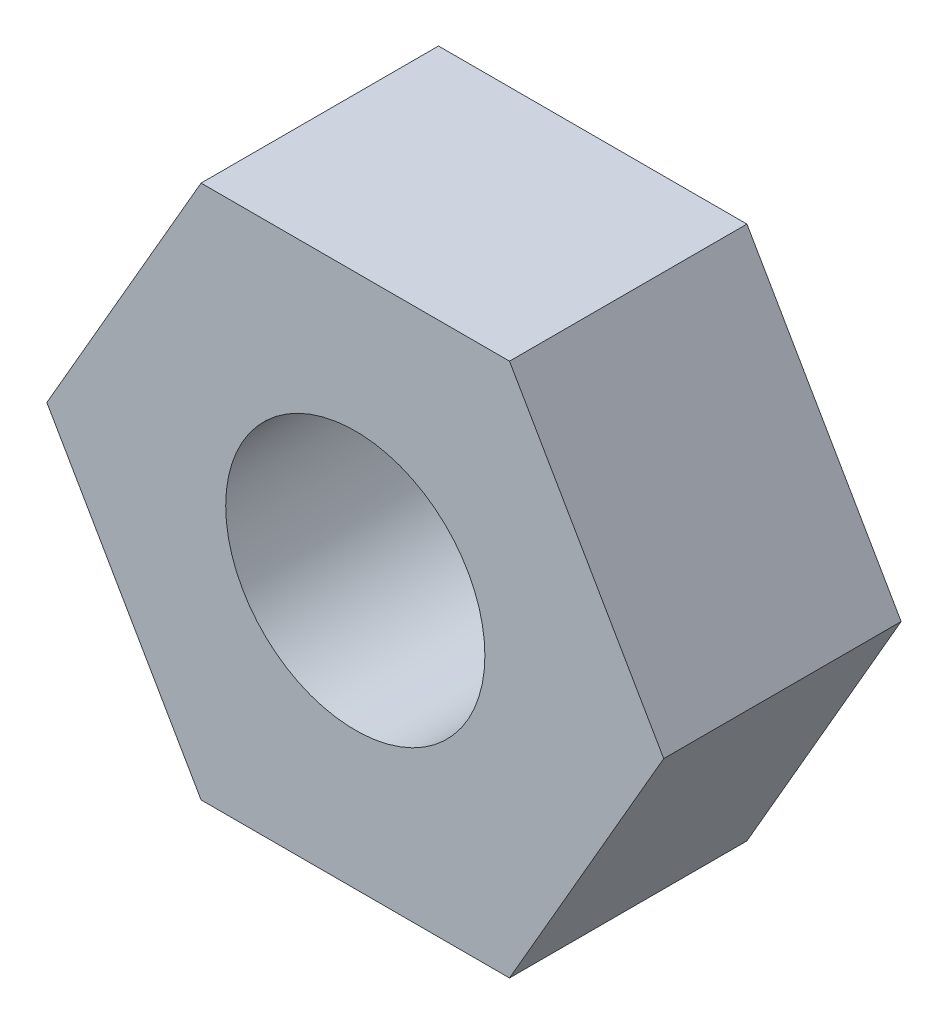
ISO-10303-21;
HEADER;
FILE_DESCRIPTION(('STEP AP214'),'2;1');
FILE_NAME('part.step','',(''),(''),'','','');
FILE_SCHEMA(('AUTOMOTIVE_DESIGN { 1 0 10303 214 1 1 1 1 }'));
ENDSEC;
DATA;
#1=APPLICATION_CONTEXT('core data for automotive mechanical design processes');
#2=APPLICATION_PROTOCOL_DEFINITION('international standard','automotive_design',2000,#1);
#3=PRODUCT_CONTEXT('',#1,'mechanical');
#4=PRODUCT('Part','Part','',(#3));
#5=PRODUCT_RELATED_PRODUCT_CATEGORY('part','',(#4));
#6=PRODUCT_DEFINITION_FORMATION('','',#4);
#7=PRODUCT_DEFINITION_CONTEXT('part definition',#1,'design');
#8=PRODUCT_DEFINITION('design','',#6,#7);
#9=PRODUCT_DEFINITION_SHAPE('','',#8);
#10=(LENGTH_UNIT() NAMED_UNIT(*) SI_UNIT(.MILLI.,.METRE.));
#11=(NAMED_UNIT(*) PLANE_ANGLE_UNIT() SI_UNIT($,.RADIAN.));
#12=(NAMED_UNIT(*) SI_UNIT($,.STERADIAN.) SOLID_ANGLE_UNIT());
#13=UNCERTAINTY_MEASURE_WITH_UNIT(LENGTH_MEASURE(1.E-05),#10,'distance_accuracy_value','');
#14=(GEOMETRIC_REPRESENTATION_CONTEXT(3) GLOBAL_UNCERTAINTY_ASSIGNED_CONTEXT((#13)) GLOBAL_UNIT_ASSIGNED_CONTEXT((#10,
#11,#12)) REPRESENTATION_CONTEXT('',''));
#15=CARTESIAN_POINT('',(0.,0.,0.));
#16=DIRECTION('',(0.,0.,1.));
#17=DIRECTION('',(1.,0.,0.));
#18=AXIS2_PLACEMENT_3D('',#15,#16,#17);
#19=CARTESIAN_POINT('',(0.,0.,3.048));
#20=DIRECTION('',(0.,0.,1.));
#21=DIRECTION('',(1.,0.,0.));
#22=AXIS2_PLACEMENT_3D('',#19,#20,#21);
#23=PLANE('',#22);
#24=DIRECTION('',(0.499999999999996,0.866025403784441,0.));
#25=VECTOR('',#24,1.);
#26=CARTESIAN_POINT('',(1.97973407305126,-3.42899999999999,3.048));
#27=LINE('',#26,#25);
#28=CARTESIAN_POINT('',(1.97973407305126,-3.42899999999999,3.048));
#29=VERTEX_POINT('',#28);
#30=CARTESIAN_POINT('',(3.95946814610246,0.,3.048));
#31=VERTEX_POINT('',#30);
#32=EDGE_CURVE('E146',#29,#31,#27,.T.);
#33=ORIENTED_EDGE('',*,*,#32,.T.);
#34=DIRECTION('',(-0.500000000000004,0.866025403784436,0.));
#35=VECTOR('',#34,1.);
#36=CARTESIAN_POINT('',(3.95946814610246,0.,3.048));
#37=LINE('',#36,#35);
#38=CARTESIAN_POINT('',(1.97973407305121,3.42900000000001,3.048));
#39=VERTEX_POINT('',#38);
#40=EDGE_CURVE('E94',#31,#39,#37,.T.);
#41=ORIENTED_EDGE('',*,*,#40,.T.);
#42=DIRECTION('',(-1.,0.,0.));
#43=VECTOR('',#42,1.);
#44=CARTESIAN_POINT('',(1.97973407305121,3.42900000000001,3.048));
#45=LINE('',#44,#43);
#46=CARTESIAN_POINT('',(-1.97973407305125,3.42899999999999,3.048));
#47=VERTEX_POINT('',#46);
#48=EDGE_CURVE('E107',#39,#47,#45,.T.);
#49=ORIENTED_EDGE('',*,*,#48,.T.);
#50=DIRECTION('',(-0.499999999999996,-0.866025403784441,0.));
#51=VECTOR('',#50,1.);
#52=CARTESIAN_POINT('',(-1.97973407305125,3.42899999999999,3.048));
#53=LINE('',#52,#51);
#54=CARTESIAN_POINT('',(-3.95946814610246,0.,3.048));
#55=VERTEX_POINT('',#54);
#56=EDGE_CURVE('E101',#47,#55,#53,.T.);
#57=ORIENTED_EDGE('',*,*,#56,.T.);
#58=DIRECTION('',(0.500000000000005,-0.866025403784436,0.));
#59=VECTOR('',#58,1.);
#60=CARTESIAN_POINT('',(-3.95946814610246,0.,3.048));
#61=LINE('',#60,#59);
#62=CARTESIAN_POINT('',(-1.97973407305121,-3.42900000000001,3.048));
#63=VERTEX_POINT('',#62);
#64=EDGE_CURVE('E105',#55,#63,#61,.T.);
#65=ORIENTED_EDGE('',*,*,#64,.T.);
#66=DIRECTION('',(1.,0.,0.));
#67=VECTOR('',#66,1.);
#68=CARTESIAN_POINT('',(-1.97973407305121,-3.42900000000001,3.048));
#69=LINE('',#68,#67);
#70=EDGE_CURVE('E57',#63,#29,#69,.T.);
#71=ORIENTED_EDGE('',*,*,#70,.T.);
#72=EDGE_LOOP('',(#33,#41,#49,#57,#65,#71));
#73=FACE_BOUND('',#72,.T.);
#74=CARTESIAN_POINT('',(0.,0.,3.048));
#75=DIRECTION('',(0.,0.,1.));
#76=DIRECTION('',(1.,0.,0.));
#77=AXIS2_PLACEMENT_3D('',#74,#75,#76);
#78=CIRCLE('',#77,1.6637);
#79=CARTESIAN_POINT('',(1.6637,0.,3.048));
#80=VERTEX_POINT('',#79);
#81=EDGE_CURVE('E134',#80,#80,#78,.T.);
#82=ORIENTED_EDGE('',*,*,#81,.F.);
#83=EDGE_LOOP('',(#82));
#84=FACE_BOUND('',#83,.T.);
#85=ADVANCED_FACE('F39',(#73,#84),#23,.T.);
#86=CARTESIAN_POINT('',(0.,0.,0.));
#87=DIRECTION('',(0.,0.,1.));
#88=DIRECTION('',(1.,0.,0.));
#89=AXIS2_PLACEMENT_3D('',#86,#87,#88);
#90=PLANE('',#89);
#91=DIRECTION('',(0.499999999999996,0.866025403784441,0.));
#92=VECTOR('',#91,1.);
#93=CARTESIAN_POINT('',(1.97973407305126,-3.42899999999999,0.));
#94=LINE('',#93,#92);
#95=CARTESIAN_POINT('',(1.97973407305126,-3.42899999999999,0.));
#96=VERTEX_POINT('',#95);
#97=CARTESIAN_POINT('',(3.95946814610246,0.,0.));
#98=VERTEX_POINT('',#97);
#99=EDGE_CURVE('E129',#96,#98,#94,.T.);
#100=ORIENTED_EDGE('',*,*,#99,.F.);
#101=DIRECTION('',(1.,0.,0.));
#102=VECTOR('',#101,1.);
#103=CARTESIAN_POINT('',(-1.97973407305121,-3.42900000000001,0.));
#104=LINE('',#103,#102);
#105=CARTESIAN_POINT('',(-1.97973407305121,-3.42900000000001,0.));
#106=VERTEX_POINT('',#105);
#107=EDGE_CURVE('E86',#106,#96,#104,.T.);
#108=ORIENTED_EDGE('',*,*,#107,.F.);
#109=DIRECTION('',(0.500000000000005,-0.866025403784436,0.));
#110=VECTOR('',#109,1.);
#111=CARTESIAN_POINT('',(-3.95946814610246,0.,0.));
#112=LINE('',#111,#110);
#113=CARTESIAN_POINT('',(-3.95946814610246,0.,0.));
#114=VERTEX_POINT('',#113);
#115=EDGE_CURVE('E80',#114,#106,#112,.T.);
#116=ORIENTED_EDGE('',*,*,#115,.F.);
#117=DIRECTION('',(-0.499999999999996,-0.866025403784441,0.));
#118=VECTOR('',#117,1.);
#119=CARTESIAN_POINT('',(-1.97973407305125,3.42899999999999,0.));
#120=LINE('',#119,#118);
#121=CARTESIAN_POINT('',(-1.97973407305125,3.42899999999999,0.));
#122=VERTEX_POINT('',#121);
#123=EDGE_CURVE('E116',#122,#114,#120,.T.);
#124=ORIENTED_EDGE('',*,*,#123,.F.);
#125=DIRECTION('',(-1.,0.,0.));
#126=VECTOR('',#125,1.);
#127=CARTESIAN_POINT('',(1.97973407305121,3.42900000000001,0.));
#128=LINE('',#127,#126);
#129=CARTESIAN_POINT('',(1.97973407305121,3.42900000000001,0.));
#130=VERTEX_POINT('',#129);
#131=EDGE_CURVE('E137',#130,#122,#128,.T.);
#132=ORIENTED_EDGE('',*,*,#131,.F.);
#133=DIRECTION('',(-0.500000000000004,0.866025403784436,0.));
#134=VECTOR('',#133,1.);
#135=CARTESIAN_POINT('',(3.95946814610246,0.,0.));
#136=LINE('',#135,#134);
#137=EDGE_CURVE('E133',#98,#130,#136,.T.);
#138=ORIENTED_EDGE('',*,*,#137,.F.);
#139=EDGE_LOOP('',(#100,#108,#116,#124,#132,#138));
#140=FACE_BOUND('',#139,.T.);
#141=CARTESIAN_POINT('',(0.,0.,0.));
#142=DIRECTION('',(0.,0.,1.));
#143=DIRECTION('',(1.,0.,0.));
#144=AXIS2_PLACEMENT_3D('',#141,#142,#143);
#145=CIRCLE('',#144,1.6637);
#146=CARTESIAN_POINT('',(1.6637,0.,0.));
#147=VERTEX_POINT('',#146);
#148=EDGE_CURVE('E243',#147,#147,#145,.T.);
#149=ORIENTED_EDGE('',*,*,#148,.T.);
#150=EDGE_LOOP('',(#149));
#151=FACE_BOUND('',#150,.T.);
#152=ADVANCED_FACE('F159',(#140,#151),#90,.F.);
#153=CARTESIAN_POINT('',(1.97973407305126,-3.42899999999999,3.048));
#154=DIRECTION('',(-0.866025403784441,0.499999999999996,0.));
#155=DIRECTION('',(-0.499999999999996,-0.866025403784441,0.));
#156=AXIS2_PLACEMENT_3D('',#153,#154,#155);
#157=PLANE('',#156);
#158=ORIENTED_EDGE('',*,*,#99,.T.);
#159=DIRECTION('',(0.,0.,-1.));
#160=VECTOR('',#159,1.);
#161=CARTESIAN_POINT('',(3.95946814610246,0.,3.048));
#162=LINE('',#161,#160);
#163=EDGE_CURVE('E11',#31,#98,#162,.T.);
#164=ORIENTED_EDGE('',*,*,#163,.F.);
#165=ORIENTED_EDGE('',*,*,#32,.F.);
#166=DIRECTION('',(0.,0.,-1.));
#167=VECTOR('',#166,1.);
#168=CARTESIAN_POINT('',(1.97973407305126,-3.42899999999999,3.048));
#169=LINE('',#168,#167);
#170=EDGE_CURVE('E125',#29,#96,#169,.T.);
#171=ORIENTED_EDGE('',*,*,#170,.T.);
#172=EDGE_LOOP('',(#158,#164,#165,#171));
#173=FACE_BOUND('',#172,.T.);
#174=ADVANCED_FACE('F41',(#173),#157,.F.);
#175=CARTESIAN_POINT('',(3.95946814610246,0.,3.048));
#176=DIRECTION('',(-0.866025403784436,-0.500000000000004,0.));
#177=DIRECTION('',(0.500000000000004,-0.866025403784436,0.));
#178=AXIS2_PLACEMENT_3D('',#175,#176,#177);
#179=PLANE('',#178);
#180=ORIENTED_EDGE('',*,*,#137,.T.);
#181=DIRECTION('',(0.,0.,-1.));
#182=VECTOR('',#181,1.);
#183=CARTESIAN_POINT('',(1.97973407305121,3.42900000000001,3.048));
#184=LINE('',#183,#182);
#185=EDGE_CURVE('E49',#39,#130,#184,.T.);
#186=ORIENTED_EDGE('',*,*,#185,.F.);
#187=ORIENTED_EDGE('',*,*,#40,.F.);
#188=ORIENTED_EDGE('',*,*,#163,.T.);
#189=EDGE_LOOP('',(#180,#186,#187,#188));
#190=FACE_BOUND('',#189,.T.);
#191=ADVANCED_FACE('F184',(#190),#179,.F.);
#192=CARTESIAN_POINT('',(1.97973407305121,3.42900000000001,3.048));
#193=DIRECTION('',(0.,-1.,0.));
#194=DIRECTION('',(1.,0.,0.));
#195=AXIS2_PLACEMENT_3D('',#192,#193,#194);
#196=PLANE('',#195);
#197=ORIENTED_EDGE('',*,*,#131,.T.);
#198=DIRECTION('',(0.,0.,-1.));
#199=VECTOR('',#198,1.);
#200=CARTESIAN_POINT('',(-1.97973407305125,3.42899999999999,3.048));
#201=LINE('',#200,#199);
#202=EDGE_CURVE('E118',#47,#122,#201,.T.);
#203=ORIENTED_EDGE('',*,*,#202,.F.);
#204=ORIENTED_EDGE('',*,*,#48,.F.);
#205=ORIENTED_EDGE('',*,*,#185,.T.);
#206=EDGE_LOOP('',(#197,#203,#204,#205));
#207=FACE_BOUND('',#206,.T.);
#208=ADVANCED_FACE('F156',(#207),#196,.F.);
#209=CARTESIAN_POINT('',(-1.97973407305125,3.42899999999999,3.048));
#210=DIRECTION('',(0.866025403784441,-0.499999999999996,0.));
#211=DIRECTION('',(0.499999999999996,0.866025403784441,0.));
#212=AXIS2_PLACEMENT_3D('',#209,#210,#211);
#213=PLANE('',#212);
#214=ORIENTED_EDGE('',*,*,#123,.T.);
#215=DIRECTION('',(0.,0.,-1.));
#216=VECTOR('',#215,1.);
#217=CARTESIAN_POINT('',(-3.95946814610246,0.,3.048));
#218=LINE('',#217,#216);
#219=EDGE_CURVE('E113',#55,#114,#218,.T.);
#220=ORIENTED_EDGE('',*,*,#219,.F.);
#221=ORIENTED_EDGE('',*,*,#56,.F.);
#222=ORIENTED_EDGE('',*,*,#202,.T.);
#223=EDGE_LOOP('',(#214,#220,#221,#222));
#224=FACE_BOUND('',#223,.T.);
#225=ADVANCED_FACE('F114',(#224),#213,.F.);
#226=CARTESIAN_POINT('',(-3.95946814610246,0.,3.048));
#227=DIRECTION('',(0.866025403784436,0.500000000000005,0.));
#228=DIRECTION('',(-0.500000000000005,0.866025403784436,0.));
#229=AXIS2_PLACEMENT_3D('',#226,#227,#228);
#230=PLANE('',#229);
#231=ORIENTED_EDGE('',*,*,#115,.T.);
#232=DIRECTION('',(0.,0.,-1.));
#233=VECTOR('',#232,1.);
#234=CARTESIAN_POINT('',(-1.97973407305121,-3.42900000000001,3.048));
#235=LINE('',#234,#233);
#236=EDGE_CURVE('E119',#63,#106,#235,.T.);
#237=ORIENTED_EDGE('',*,*,#236,.F.);
#238=ORIENTED_EDGE('',*,*,#64,.F.);
#239=ORIENTED_EDGE('',*,*,#219,.T.);
#240=EDGE_LOOP('',(#231,#237,#238,#239));
#241=FACE_BOUND('',#240,.T.);
#242=ADVANCED_FACE('F121',(#241),#230,.F.);
#243=CARTESIAN_POINT('',(-1.97973407305121,-3.42900000000001,3.048));
#244=DIRECTION('',(0.,1.,0.));
#245=DIRECTION('',(-1.,0.,0.));
#246=AXIS2_PLACEMENT_3D('',#243,#244,#245);
#247=PLANE('',#246);
#248=ORIENTED_EDGE('',*,*,#107,.T.);
#249=ORIENTED_EDGE('',*,*,#170,.F.);
#250=ORIENTED_EDGE('',*,*,#70,.F.);
#251=ORIENTED_EDGE('',*,*,#236,.T.);
#252=EDGE_LOOP('',(#248,#249,#250,#251));
#253=FACE_BOUND('',#252,.T.);
#254=ADVANCED_FACE('F164',(#253),#247,.F.);
#255=CARTESIAN_POINT('',(0.,0.,3.048));
#256=DIRECTION('',(0.,0.,-1.));
#257=DIRECTION('',(-1.,0.,0.));
#258=AXIS2_PLACEMENT_3D('',#255,#256,#257);
#259=CYLINDRICAL_SURFACE('',#258,1.6637);
#260=ORIENTED_EDGE('',*,*,#81,.T.);
#261=EDGE_LOOP('',(#260));
#262=FACE_BOUND('',#261,.T.);
#263=ORIENTED_EDGE('',*,*,#148,.F.);
#264=EDGE_LOOP('',(#263));
#265=FACE_BOUND('',#264,.T.);
#266=ADVANCED_FACE('F166',(#262,#265),#259,.F.);
#267=CLOSED_SHELL('',(#85,#152,#174,#191,#208,#225,#242,#254,#266));
#268=MANIFOLD_SOLID_BREP('B2',#267);
#269=ADVANCED_BREP_SHAPE_REPRESENTATION('',(#18,#268),#14);
#270=SHAPE_DEFINITION_REPRESENTATION(#9,#269);
ENDSEC;
END-ISO-10303-21;
